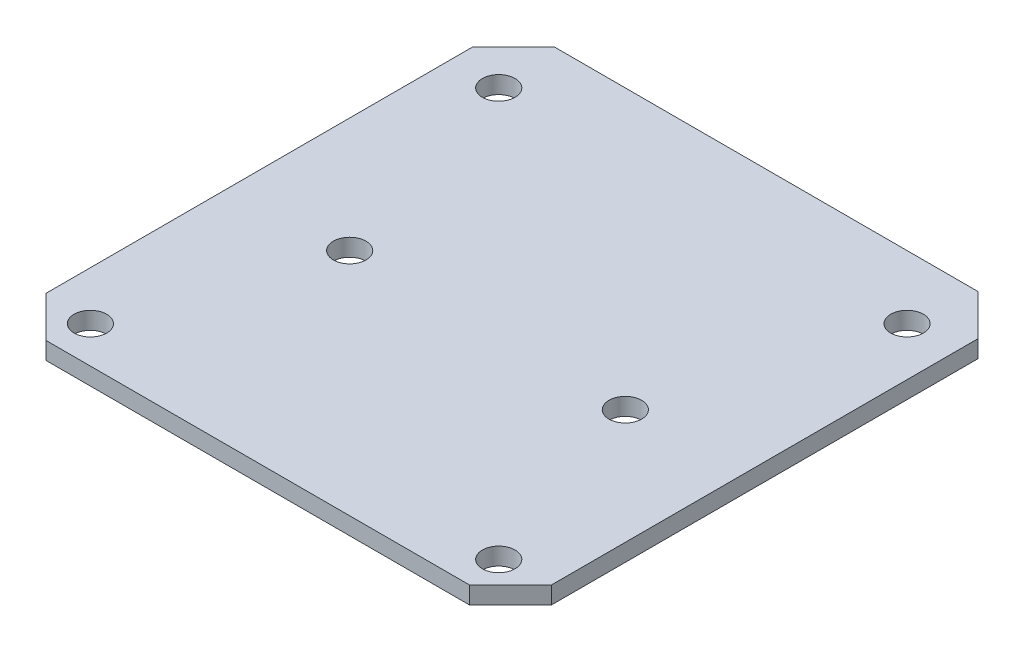
ISO-10303-21;
HEADER;
FILE_DESCRIPTION(('STEP AP214'),'2;1');
FILE_NAME('part.step','',(''),(''),'','','');
FILE_SCHEMA(('AUTOMOTIVE_DESIGN { 1 0 10303 214 1 1 1 1 }'));
ENDSEC;
DATA;
#1=APPLICATION_CONTEXT('core data for automotive mechanical design processes');
#2=APPLICATION_PROTOCOL_DEFINITION('international standard','automotive_design',2000,#1);
#3=PRODUCT_CONTEXT('',#1,'mechanical');
#4=PRODUCT('Part','Part','',(#3));
#5=PRODUCT_RELATED_PRODUCT_CATEGORY('part','',(#4));
#6=PRODUCT_DEFINITION_FORMATION('','',#4);
#7=PRODUCT_DEFINITION_CONTEXT('part definition',#1,'design');
#8=PRODUCT_DEFINITION('design','',#6,#7);
#9=PRODUCT_DEFINITION_SHAPE('','',#8);
#10=(LENGTH_UNIT() NAMED_UNIT(*) SI_UNIT(.MILLI.,.METRE.));
#11=(NAMED_UNIT(*) PLANE_ANGLE_UNIT() SI_UNIT($,.RADIAN.));
#12=(NAMED_UNIT(*) SI_UNIT($,.STERADIAN.) SOLID_ANGLE_UNIT());
#13=UNCERTAINTY_MEASURE_WITH_UNIT(LENGTH_MEASURE(1.E-05),#10,'distance_accuracy_value','');
#14=(GEOMETRIC_REPRESENTATION_CONTEXT(3) GLOBAL_UNCERTAINTY_ASSIGNED_CONTEXT((#13)) GLOBAL_UNIT_ASSIGNED_CONTEXT((#10,
#11,#12)) REPRESENTATION_CONTEXT('',''));
#15=CARTESIAN_POINT('',(0.,0.,0.));
#16=DIRECTION('',(0.,0.,1.));
#17=DIRECTION('',(1.,0.,0.));
#18=AXIS2_PLACEMENT_3D('',#15,#16,#17);
#19=CARTESIAN_POINT('',(24.75,1.7,-24.9));
#20=DIRECTION('',(-1.,0.,0.));
#21=DIRECTION('',(0.,0.,1.));
#22=AXIS2_PLACEMENT_3D('',#19,#20,#21);
#23=PLANE('',#22);
#24=DIRECTION('',(0.,0.,-1.));
#25=VECTOR('',#24,1.);
#26=CARTESIAN_POINT('',(24.75,1.7,-24.9));
#27=LINE('',#26,#25);
#28=CARTESIAN_POINT('',(24.75,1.7,20.9));
#29=VERTEX_POINT('',#28);
#30=CARTESIAN_POINT('',(24.75,1.7,-20.9));
#31=VERTEX_POINT('',#30);
#32=EDGE_CURVE('E131',#29,#31,#27,.T.);
#33=ORIENTED_EDGE('',*,*,#32,.F.);
#34=DIRECTION('',(0.,-1.,0.));
#35=VECTOR('',#34,1.);
#36=CARTESIAN_POINT('',(24.75,1.7,20.9));
#37=LINE('',#36,#35);
#38=CARTESIAN_POINT('',(24.75,0.,20.9));
#39=VERTEX_POINT('',#38);
#40=EDGE_CURVE('E157',#29,#39,#37,.T.);
#41=ORIENTED_EDGE('',*,*,#40,.T.);
#42=DIRECTION('',(0.,0.,-1.));
#43=VECTOR('',#42,1.);
#44=CARTESIAN_POINT('',(24.75,0.,-24.9));
#45=LINE('',#44,#43);
#46=CARTESIAN_POINT('',(24.75,0.,-20.9));
#47=VERTEX_POINT('',#46);
#48=EDGE_CURVE('E163',#39,#47,#45,.T.);
#49=ORIENTED_EDGE('',*,*,#48,.T.);
#50=DIRECTION('',(0.,1.,0.));
#51=VECTOR('',#50,1.);
#52=CARTESIAN_POINT('',(24.75,1.7,-20.9));
#53=LINE('',#52,#51);
#54=EDGE_CURVE('E155',#47,#31,#53,.T.);
#55=ORIENTED_EDGE('',*,*,#54,.T.);
#56=EDGE_LOOP('',(#33,#41,#49,#55));
#57=FACE_BOUND('',#56,.T.);
#58=ADVANCED_FACE('F39',(#57),#23,.F.);
#59=CARTESIAN_POINT('',(-24.75,1.7,-24.9));
#60=DIRECTION('',(0.,0.,1.));
#61=DIRECTION('',(1.,0.,0.));
#62=AXIS2_PLACEMENT_3D('',#59,#60,#61);
#63=PLANE('',#62);
#64=DIRECTION('',(-1.,0.,0.));
#65=VECTOR('',#64,1.);
#66=CARTESIAN_POINT('',(-24.75,1.7,-24.9));
#67=LINE('',#66,#65);
#68=CARTESIAN_POINT('',(20.75,1.7,-24.9));
#69=VERTEX_POINT('',#68);
#70=CARTESIAN_POINT('',(-20.75,1.7,-24.9));
#71=VERTEX_POINT('',#70);
#72=EDGE_CURVE('E134',#69,#71,#67,.T.);
#73=ORIENTED_EDGE('',*,*,#72,.F.);
#74=DIRECTION('',(0.,-1.,0.));
#75=VECTOR('',#74,1.);
#76=CARTESIAN_POINT('',(20.75,1.7,-24.9));
#77=LINE('',#76,#75);
#78=CARTESIAN_POINT('',(20.75,0.,-24.9));
#79=VERTEX_POINT('',#78);
#80=EDGE_CURVE('E11',#69,#79,#77,.T.);
#81=ORIENTED_EDGE('',*,*,#80,.T.);
#82=DIRECTION('',(-1.,0.,0.));
#83=VECTOR('',#82,1.);
#84=CARTESIAN_POINT('',(-24.75,0.,-24.9));
#85=LINE('',#84,#83);
#86=CARTESIAN_POINT('',(-20.75,0.,-24.9));
#87=VERTEX_POINT('',#86);
#88=EDGE_CURVE('E136',#79,#87,#85,.T.);
#89=ORIENTED_EDGE('',*,*,#88,.T.);
#90=DIRECTION('',(0.,1.,0.));
#91=VECTOR('',#90,1.);
#92=CARTESIAN_POINT('',(-20.75,1.7,-24.9));
#93=LINE('',#92,#91);
#94=EDGE_CURVE('E47',#87,#71,#93,.T.);
#95=ORIENTED_EDGE('',*,*,#94,.T.);
#96=EDGE_LOOP('',(#73,#81,#89,#95));
#97=FACE_BOUND('',#96,.T.);
#98=ADVANCED_FACE('F233',(#97),#63,.F.);
#99=CARTESIAN_POINT('',(-24.75,1.7,-24.9));
#100=DIRECTION('',(1.,0.,0.));
#101=DIRECTION('',(0.,0.,-1.));
#102=AXIS2_PLACEMENT_3D('',#99,#100,#101);
#103=PLANE('',#102);
#104=DIRECTION('',(0.,0.,1.));
#105=VECTOR('',#104,1.);
#106=CARTESIAN_POINT('',(-24.75,0.,-24.9));
#107=LINE('',#106,#105);
#108=CARTESIAN_POINT('',(-24.75,0.,-20.9));
#109=VERTEX_POINT('',#108);
#110=CARTESIAN_POINT('',(-24.75,0.,20.9));
#111=VERTEX_POINT('',#110);
#112=EDGE_CURVE('E132',#109,#111,#107,.T.);
#113=ORIENTED_EDGE('',*,*,#112,.T.);
#114=DIRECTION('',(0.,1.,0.));
#115=VECTOR('',#114,1.);
#116=CARTESIAN_POINT('',(-24.75,1.7,20.9));
#117=LINE('',#116,#115);
#118=CARTESIAN_POINT('',(-24.75,1.7,20.9));
#119=VERTEX_POINT('',#118);
#120=EDGE_CURVE('E110',#111,#119,#117,.T.);
#121=ORIENTED_EDGE('',*,*,#120,.T.);
#122=DIRECTION('',(0.,0.,1.));
#123=VECTOR('',#122,1.);
#124=CARTESIAN_POINT('',(-24.75,1.7,-24.9));
#125=LINE('',#124,#123);
#126=CARTESIAN_POINT('',(-24.75,1.7,-20.9));
#127=VERTEX_POINT('',#126);
#128=EDGE_CURVE('E175',#127,#119,#125,.T.);
#129=ORIENTED_EDGE('',*,*,#128,.F.);
#130=DIRECTION('',(0.,-1.,0.));
#131=VECTOR('',#130,1.);
#132=CARTESIAN_POINT('',(-24.75,1.7,-20.9));
#133=LINE('',#132,#131);
#134=EDGE_CURVE('E115',#127,#109,#133,.T.);
#135=ORIENTED_EDGE('',*,*,#134,.T.);
#136=EDGE_LOOP('',(#113,#121,#129,#135));
#137=FACE_BOUND('',#136,.T.);
#138=ADVANCED_FACE('F231',(#137),#103,.F.);
#139=CARTESIAN_POINT('',(-24.75,1.7,24.9));
#140=DIRECTION('',(0.,0.,-1.));
#141=DIRECTION('',(-1.,0.,0.));
#142=AXIS2_PLACEMENT_3D('',#139,#140,#141);
#143=PLANE('',#142);
#144=DIRECTION('',(1.,0.,0.));
#145=VECTOR('',#144,1.);
#146=CARTESIAN_POINT('',(-24.75,1.7,24.9));
#147=LINE('',#146,#145);
#148=CARTESIAN_POINT('',(-20.75,1.7,24.9));
#149=VERTEX_POINT('',#148);
#150=CARTESIAN_POINT('',(20.75,1.7,24.9));
#151=VERTEX_POINT('',#150);
#152=EDGE_CURVE('E125',#149,#151,#147,.T.);
#153=ORIENTED_EDGE('',*,*,#152,.F.);
#154=DIRECTION('',(0.,-1.,0.));
#155=VECTOR('',#154,1.);
#156=CARTESIAN_POINT('',(-20.75,1.7,24.9));
#157=LINE('',#156,#155);
#158=CARTESIAN_POINT('',(-20.75,0.,24.9));
#159=VERTEX_POINT('',#158);
#160=EDGE_CURVE('E109',#149,#159,#157,.T.);
#161=ORIENTED_EDGE('',*,*,#160,.T.);
#162=DIRECTION('',(1.,0.,0.));
#163=VECTOR('',#162,1.);
#164=CARTESIAN_POINT('',(-24.75,0.,24.9));
#165=LINE('',#164,#163);
#166=CARTESIAN_POINT('',(20.75,0.,24.9));
#167=VERTEX_POINT('',#166);
#168=EDGE_CURVE('E122',#159,#167,#165,.T.);
#169=ORIENTED_EDGE('',*,*,#168,.T.);
#170=DIRECTION('',(0.,1.,0.));
#171=VECTOR('',#170,1.);
#172=CARTESIAN_POINT('',(20.75,1.7,24.9));
#173=LINE('',#172,#171);
#174=EDGE_CURVE('E127',#167,#151,#173,.T.);
#175=ORIENTED_EDGE('',*,*,#174,.T.);
#176=EDGE_LOOP('',(#153,#161,#169,#175));
#177=FACE_BOUND('',#176,.T.);
#178=ADVANCED_FACE('F121',(#177),#143,.F.);
#179=CARTESIAN_POINT('',(0.,1.7,0.));
#180=DIRECTION('',(0.,1.,0.));
#181=DIRECTION('',(0.,0.,1.));
#182=AXIS2_PLACEMENT_3D('',#179,#180,#181);
#183=PLANE('',#182);
#184=CARTESIAN_POINT('',(-13.5,1.7,2.4));
#185=DIRECTION('',(0.,1.,0.));
#186=DIRECTION('',(0.,0.,1.));
#187=AXIS2_PLACEMENT_3D('',#184,#185,#186);
#188=CIRCLE('',#187,1.59999999999999);
#189=CARTESIAN_POINT('',(-13.5,1.7,3.99999999999999));
#190=VERTEX_POINT('',#189);
#191=EDGE_CURVE('E208',#190,#190,#188,.T.);
#192=ORIENTED_EDGE('',*,*,#191,.F.);
#193=EDGE_LOOP('',(#192));
#194=FACE_BOUND('',#193,.T.);
#195=CARTESIAN_POINT('',(13.5,1.7,2.4));
#196=DIRECTION('',(0.,1.,0.));
#197=DIRECTION('',(0.,0.,1.));
#198=AXIS2_PLACEMENT_3D('',#195,#196,#197);
#199=CIRCLE('',#198,1.59999999999999);
#200=CARTESIAN_POINT('',(13.5,1.7,3.99999999999999));
#201=VERTEX_POINT('',#200);
#202=EDGE_CURVE('E202',#201,#201,#199,.T.);
#203=ORIENTED_EDGE('',*,*,#202,.F.);
#204=EDGE_LOOP('',(#203));
#205=FACE_BOUND('',#204,.T.);
#206=CARTESIAN_POINT('',(-20.,1.7,21.3));
#207=DIRECTION('',(0.,1.,0.));
#208=DIRECTION('',(0.,0.,1.));
#209=AXIS2_PLACEMENT_3D('',#206,#207,#208);
#210=CIRCLE('',#209,1.59999999999999);
#211=CARTESIAN_POINT('',(-20.,1.7,22.9));
#212=VERTEX_POINT('',#211);
#213=EDGE_CURVE('E193',#212,#212,#210,.T.);
#214=ORIENTED_EDGE('',*,*,#213,.F.);
#215=EDGE_LOOP('',(#214));
#216=FACE_BOUND('',#215,.T.);
#217=CARTESIAN_POINT('',(20.,1.7,21.3));
#218=DIRECTION('',(0.,1.,0.));
#219=DIRECTION('',(0.,0.,1.));
#220=AXIS2_PLACEMENT_3D('',#217,#218,#219);
#221=CIRCLE('',#220,1.59999999999999);
#222=CARTESIAN_POINT('',(20.,1.7,22.9));
#223=VERTEX_POINT('',#222);
#224=EDGE_CURVE('E190',#223,#223,#221,.T.);
#225=ORIENTED_EDGE('',*,*,#224,.F.);
#226=EDGE_LOOP('',(#225));
#227=FACE_BOUND('',#226,.T.);
#228=CARTESIAN_POINT('',(20.,1.7,-18.7));
#229=DIRECTION('',(0.,1.,0.));
#230=DIRECTION('',(0.,0.,1.));
#231=AXIS2_PLACEMENT_3D('',#228,#229,#230);
#232=CIRCLE('',#231,1.59999999999999);
#233=CARTESIAN_POINT('',(20.,1.7,-17.1));
#234=VERTEX_POINT('',#233);
#235=EDGE_CURVE('E184',#234,#234,#232,.T.);
#236=ORIENTED_EDGE('',*,*,#235,.F.);
#237=EDGE_LOOP('',(#236));
#238=FACE_BOUND('',#237,.T.);
#239=CARTESIAN_POINT('',(-20.,1.7,-18.7));
#240=DIRECTION('',(0.,1.,0.));
#241=DIRECTION('',(0.,0.,1.));
#242=AXIS2_PLACEMENT_3D('',#239,#240,#241);
#243=CIRCLE('',#242,1.59999999999999);
#244=CARTESIAN_POINT('',(-20.,1.7,-17.1));
#245=VERTEX_POINT('',#244);
#246=EDGE_CURVE('E171',#245,#245,#243,.T.);
#247=ORIENTED_EDGE('',*,*,#246,.F.);
#248=EDGE_LOOP('',(#247));
#249=FACE_BOUND('',#248,.T.);
#250=ORIENTED_EDGE('',*,*,#128,.T.);
#251=DIRECTION('',(-0.707106781186546,0.,-0.707106781186549));
#252=VECTOR('',#251,1.);
#253=CARTESIAN_POINT('',(-22.825,1.7,22.8249999999999));
#254=LINE('',#253,#252);
#255=EDGE_CURVE('E153',#119,#149,#254,.F.);
#256=ORIENTED_EDGE('',*,*,#255,.T.);
#257=ORIENTED_EDGE('',*,*,#152,.T.);
#258=DIRECTION('',(-0.707106781186549,0.,0.707106781186546));
#259=VECTOR('',#258,1.);
#260=CARTESIAN_POINT('',(22.8249999999999,1.7,22.825));
#261=LINE('',#260,#259);
#262=EDGE_CURVE('E151',#151,#29,#261,.F.);
#263=ORIENTED_EDGE('',*,*,#262,.T.);
#264=ORIENTED_EDGE('',*,*,#32,.T.);
#265=DIRECTION('',(0.707106781186546,0.,0.707106781186549));
#266=VECTOR('',#265,1.);
#267=CARTESIAN_POINT('',(22.8250000000001,1.7,-22.8249999999999));
#268=LINE('',#267,#266);
#269=EDGE_CURVE('E60',#31,#69,#268,.F.);
#270=ORIENTED_EDGE('',*,*,#269,.T.);
#271=ORIENTED_EDGE('',*,*,#72,.T.);
#272=DIRECTION('',(0.707106781186549,0.,-0.707106781186546));
#273=VECTOR('',#272,1.);
#274=CARTESIAN_POINT('',(-22.8249999999999,1.7,-22.825));
#275=LINE('',#274,#273);
#276=EDGE_CURVE('E148',#71,#127,#275,.F.);
#277=ORIENTED_EDGE('',*,*,#276,.T.);
#278=EDGE_LOOP('',(#250,#256,#257,#263,#264,#270,#271,#277));
#279=FACE_BOUND('',#278,.T.);
#280=ADVANCED_FACE('F214',(#194,#205,#216,#227,#238,#249,#279),#183,.T.);
#281=CARTESIAN_POINT('',(0.,0.,0.));
#282=DIRECTION('',(0.,1.,0.));
#283=DIRECTION('',(0.,0.,1.));
#284=AXIS2_PLACEMENT_3D('',#281,#282,#283);
#285=PLANE('',#284);
#286=CARTESIAN_POINT('',(-13.5,0.,2.4));
#287=DIRECTION('',(0.,1.,0.));
#288=DIRECTION('',(0.,0.,1.));
#289=AXIS2_PLACEMENT_3D('',#286,#287,#288);
#290=CIRCLE('',#289,1.6);
#291=CARTESIAN_POINT('',(-13.5,0.,4.));
#292=VERTEX_POINT('',#291);
#293=EDGE_CURVE('E205',#292,#292,#290,.T.);
#294=ORIENTED_EDGE('',*,*,#293,.T.);
#295=EDGE_LOOP('',(#294));
#296=FACE_BOUND('',#295,.T.);
#297=CARTESIAN_POINT('',(13.5,0.,2.4));
#298=DIRECTION('',(0.,1.,0.));
#299=DIRECTION('',(0.,0.,1.));
#300=AXIS2_PLACEMENT_3D('',#297,#298,#299);
#301=CIRCLE('',#300,1.6);
#302=CARTESIAN_POINT('',(13.5,0.,4.));
#303=VERTEX_POINT('',#302);
#304=EDGE_CURVE('E199',#303,#303,#301,.T.);
#305=ORIENTED_EDGE('',*,*,#304,.T.);
#306=EDGE_LOOP('',(#305));
#307=FACE_BOUND('',#306,.T.);
#308=CARTESIAN_POINT('',(-20.,0.,21.3));
#309=DIRECTION('',(0.,1.,0.));
#310=DIRECTION('',(0.,0.,1.));
#311=AXIS2_PLACEMENT_3D('',#308,#309,#310);
#312=CIRCLE('',#311,1.6);
#313=CARTESIAN_POINT('',(-20.,0.,22.9));
#314=VERTEX_POINT('',#313);
#315=EDGE_CURVE('E196',#314,#314,#312,.T.);
#316=ORIENTED_EDGE('',*,*,#315,.T.);
#317=EDGE_LOOP('',(#316));
#318=FACE_BOUND('',#317,.T.);
#319=CARTESIAN_POINT('',(20.,0.,21.3));
#320=DIRECTION('',(0.,1.,0.));
#321=DIRECTION('',(0.,0.,1.));
#322=AXIS2_PLACEMENT_3D('',#319,#320,#321);
#323=CIRCLE('',#322,1.6);
#324=CARTESIAN_POINT('',(20.,0.,22.9));
#325=VERTEX_POINT('',#324);
#326=EDGE_CURVE('E187',#325,#325,#323,.T.);
#327=ORIENTED_EDGE('',*,*,#326,.T.);
#328=EDGE_LOOP('',(#327));
#329=FACE_BOUND('',#328,.T.);
#330=CARTESIAN_POINT('',(20.,0.,-18.7));
#331=DIRECTION('',(0.,1.,0.));
#332=DIRECTION('',(0.,0.,1.));
#333=AXIS2_PLACEMENT_3D('',#330,#331,#332);
#334=CIRCLE('',#333,1.6);
#335=CARTESIAN_POINT('',(20.,0.,-17.1));
#336=VERTEX_POINT('',#335);
#337=EDGE_CURVE('E181',#336,#336,#334,.T.);
#338=ORIENTED_EDGE('',*,*,#337,.T.);
#339=EDGE_LOOP('',(#338));
#340=FACE_BOUND('',#339,.T.);
#341=CARTESIAN_POINT('',(-20.,0.,-18.7));
#342=DIRECTION('',(0.,1.,0.));
#343=DIRECTION('',(0.,0.,1.));
#344=AXIS2_PLACEMENT_3D('',#341,#342,#343);
#345=CIRCLE('',#344,1.6);
#346=CARTESIAN_POINT('',(-20.,0.,-17.1));
#347=VERTEX_POINT('',#346);
#348=EDGE_CURVE('E168',#347,#347,#345,.T.);
#349=ORIENTED_EDGE('',*,*,#348,.T.);
#350=EDGE_LOOP('',(#349));
#351=FACE_BOUND('',#350,.T.);
#352=ORIENTED_EDGE('',*,*,#168,.F.);
#353=DIRECTION('',(0.707106781186546,0.,0.707106781186549));
#354=VECTOR('',#353,1.);
#355=CARTESIAN_POINT('',(-20.75,0.,24.9));
#356=LINE('',#355,#354);
#357=EDGE_CURVE('E105',#159,#111,#356,.F.);
#358=ORIENTED_EDGE('',*,*,#357,.T.);
#359=ORIENTED_EDGE('',*,*,#112,.F.);
#360=DIRECTION('',(-0.707106781186549,0.,0.707106781186546));
#361=VECTOR('',#360,1.);
#362=CARTESIAN_POINT('',(-24.75,0.,-20.9));
#363=LINE('',#362,#361);
#364=EDGE_CURVE('E126',#109,#87,#363,.F.);
#365=ORIENTED_EDGE('',*,*,#364,.T.);
#366=ORIENTED_EDGE('',*,*,#88,.F.);
#367=DIRECTION('',(-0.707106781186546,0.,-0.707106781186549));
#368=VECTOR('',#367,1.);
#369=CARTESIAN_POINT('',(20.75,0.,-24.9));
#370=LINE('',#369,#368);
#371=EDGE_CURVE('E142',#79,#47,#370,.F.);
#372=ORIENTED_EDGE('',*,*,#371,.T.);
#373=ORIENTED_EDGE('',*,*,#48,.F.);
#374=DIRECTION('',(0.707106781186549,0.,-0.707106781186546));
#375=VECTOR('',#374,1.);
#376=CARTESIAN_POINT('',(24.75,0.,20.9));
#377=LINE('',#376,#375);
#378=EDGE_CURVE('E116',#39,#167,#377,.F.);
#379=ORIENTED_EDGE('',*,*,#378,.T.);
#380=EDGE_LOOP('',(#352,#358,#359,#365,#366,#372,#373,#379));
#381=FACE_BOUND('',#380,.T.);
#382=ADVANCED_FACE('F129',(#296,#307,#318,#329,#340,#351,#381),#285,.F.);
#383=CARTESIAN_POINT('',(-20.,1.7,-18.7));
#384=DIRECTION('',(0.,1.,0.));
#385=DIRECTION('',(0.,0.,1.));
#386=AXIS2_PLACEMENT_3D('',#383,#384,#385);
#387=CYLINDRICAL_SURFACE('',#386,1.59999999999999);
#388=ORIENTED_EDGE('',*,*,#348,.F.);
#389=EDGE_LOOP('',(#388));
#390=FACE_BOUND('',#389,.T.);
#391=ORIENTED_EDGE('',*,*,#246,.T.);
#392=EDGE_LOOP('',(#391));
#393=FACE_BOUND('',#392,.T.);
#394=ADVANCED_FACE('F258',(#390,#393),#387,.F.);
#395=CARTESIAN_POINT('',(20.,1.7,-18.7));
#396=DIRECTION('',(0.,1.,0.));
#397=DIRECTION('',(0.,0.,1.));
#398=AXIS2_PLACEMENT_3D('',#395,#396,#397);
#399=CYLINDRICAL_SURFACE('',#398,1.59999999999999);
#400=ORIENTED_EDGE('',*,*,#337,.F.);
#401=EDGE_LOOP('',(#400));
#402=FACE_BOUND('',#401,.T.);
#403=ORIENTED_EDGE('',*,*,#235,.T.);
#404=EDGE_LOOP('',(#403));
#405=FACE_BOUND('',#404,.T.);
#406=ADVANCED_FACE('F263',(#402,#405),#399,.F.);
#407=CARTESIAN_POINT('',(20.,1.7,21.3));
#408=DIRECTION('',(0.,1.,0.));
#409=DIRECTION('',(0.,0.,1.));
#410=AXIS2_PLACEMENT_3D('',#407,#408,#409);
#411=CYLINDRICAL_SURFACE('',#410,1.59999999999999);
#412=ORIENTED_EDGE('',*,*,#326,.F.);
#413=EDGE_LOOP('',(#412));
#414=FACE_BOUND('',#413,.T.);
#415=ORIENTED_EDGE('',*,*,#224,.T.);
#416=EDGE_LOOP('',(#415));
#417=FACE_BOUND('',#416,.T.);
#418=ADVANCED_FACE('F267',(#414,#417),#411,.F.);
#419=CARTESIAN_POINT('',(-20.,1.7,21.3));
#420=DIRECTION('',(0.,1.,0.));
#421=DIRECTION('',(0.,0.,1.));
#422=AXIS2_PLACEMENT_3D('',#419,#420,#421);
#423=CYLINDRICAL_SURFACE('',#422,1.59999999999999);
#424=ORIENTED_EDGE('',*,*,#315,.F.);
#425=EDGE_LOOP('',(#424));
#426=FACE_BOUND('',#425,.T.);
#427=ORIENTED_EDGE('',*,*,#213,.T.);
#428=EDGE_LOOP('',(#427));
#429=FACE_BOUND('',#428,.T.);
#430=ADVANCED_FACE('F271',(#426,#429),#423,.F.);
#431=CARTESIAN_POINT('',(13.5,1.7,2.4));
#432=DIRECTION('',(0.,1.,0.));
#433=DIRECTION('',(0.,0.,1.));
#434=AXIS2_PLACEMENT_3D('',#431,#432,#433);
#435=CYLINDRICAL_SURFACE('',#434,1.59999999999999);
#436=ORIENTED_EDGE('',*,*,#304,.F.);
#437=EDGE_LOOP('',(#436));
#438=FACE_BOUND('',#437,.T.);
#439=ORIENTED_EDGE('',*,*,#202,.T.);
#440=EDGE_LOOP('',(#439));
#441=FACE_BOUND('',#440,.T.);
#442=ADVANCED_FACE('F275',(#438,#441),#435,.F.);
#443=CARTESIAN_POINT('',(-13.5,1.7,2.4));
#444=DIRECTION('',(0.,1.,0.));
#445=DIRECTION('',(0.,0.,1.));
#446=AXIS2_PLACEMENT_3D('',#443,#444,#445);
#447=CYLINDRICAL_SURFACE('',#446,1.59999999999999);
#448=ORIENTED_EDGE('',*,*,#293,.F.);
#449=EDGE_LOOP('',(#448));
#450=FACE_BOUND('',#449,.T.);
#451=ORIENTED_EDGE('',*,*,#191,.T.);
#452=EDGE_LOOP('',(#451));
#453=FACE_BOUND('',#452,.T.);
#454=ADVANCED_FACE('F212',(#450,#453),#447,.F.);
#455=CARTESIAN_POINT('',(-20.75,1.7,24.9));
#456=DIRECTION('',(0.707106781186549,0.,-0.707106781186546));
#457=DIRECTION('',(0.,-1.,0.));
#458=AXIS2_PLACEMENT_3D('',#455,#456,#457);
#459=PLANE('',#458);
#460=ORIENTED_EDGE('',*,*,#255,.F.);
#461=ORIENTED_EDGE('',*,*,#120,.F.);
#462=ORIENTED_EDGE('',*,*,#357,.F.);
#463=ORIENTED_EDGE('',*,*,#160,.F.);
#464=EDGE_LOOP('',(#460,#461,#462,#463));
#465=FACE_BOUND('',#464,.T.);
#466=ADVANCED_FACE('F108',(#465),#459,.F.);
#467=CARTESIAN_POINT('',(24.75,1.7,20.9));
#468=DIRECTION('',(-0.707106781186546,0.,-0.707106781186549));
#469=DIRECTION('',(0.,-1.,0.));
#470=AXIS2_PLACEMENT_3D('',#467,#468,#469);
#471=PLANE('',#470);
#472=ORIENTED_EDGE('',*,*,#262,.F.);
#473=ORIENTED_EDGE('',*,*,#174,.F.);
#474=ORIENTED_EDGE('',*,*,#378,.F.);
#475=ORIENTED_EDGE('',*,*,#40,.F.);
#476=EDGE_LOOP('',(#472,#473,#474,#475));
#477=FACE_BOUND('',#476,.T.);
#478=ADVANCED_FACE('F237',(#477),#471,.F.);
#479=CARTESIAN_POINT('',(20.75,1.7,-24.9));
#480=DIRECTION('',(-0.707106781186549,0.,0.707106781186546));
#481=DIRECTION('',(0.,-1.,0.));
#482=AXIS2_PLACEMENT_3D('',#479,#480,#481);
#483=PLANE('',#482);
#484=ORIENTED_EDGE('',*,*,#269,.F.);
#485=ORIENTED_EDGE('',*,*,#54,.F.);
#486=ORIENTED_EDGE('',*,*,#371,.F.);
#487=ORIENTED_EDGE('',*,*,#80,.F.);
#488=EDGE_LOOP('',(#484,#485,#486,#487));
#489=FACE_BOUND('',#488,.T.);
#490=ADVANCED_FACE('F236',(#489),#483,.F.);
#491=CARTESIAN_POINT('',(-24.75,1.7,-20.9));
#492=DIRECTION('',(0.707106781186546,0.,0.707106781186549));
#493=DIRECTION('',(0.,-1.,0.));
#494=AXIS2_PLACEMENT_3D('',#491,#492,#493);
#495=PLANE('',#494);
#496=ORIENTED_EDGE('',*,*,#276,.F.);
#497=ORIENTED_EDGE('',*,*,#94,.F.);
#498=ORIENTED_EDGE('',*,*,#364,.F.);
#499=ORIENTED_EDGE('',*,*,#134,.F.);
#500=EDGE_LOOP('',(#496,#497,#498,#499));
#501=FACE_BOUND('',#500,.T.);
#502=ADVANCED_FACE('F41',(#501),#495,.F.);
#503=CLOSED_SHELL('',(#58,#98,#138,#178,#280,#382,#394,#406,#418,#430,#442,#454,#466,#478,#490,#502));
#504=MANIFOLD_SOLID_BREP('B2',#503);
#505=ADVANCED_BREP_SHAPE_REPRESENTATION('',(#18,#504),#14);
#506=SHAPE_DEFINITION_REPRESENTATION(#9,#505);
ENDSEC;
END-ISO-10303-21;
